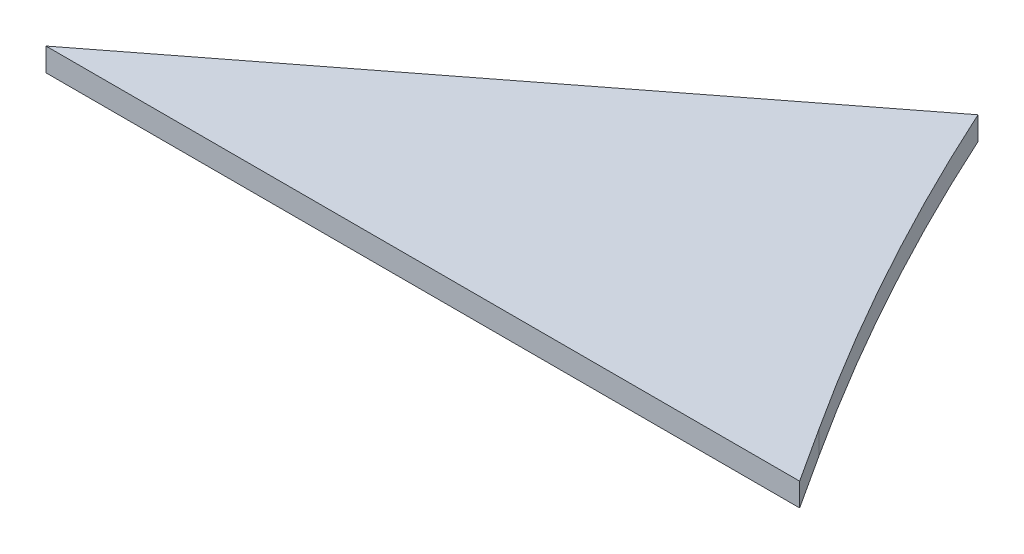
ISO-10303-21;
HEADER;
FILE_DESCRIPTION(('STEP AP214'),'2;1');
FILE_NAME('part.step','',(''),(''),'','','');
FILE_SCHEMA(('AUTOMOTIVE_DESIGN { 1 0 10303 214 1 1 1 1 }'));
ENDSEC;
DATA;
#1=APPLICATION_CONTEXT('core data for automotive mechanical design processes');
#2=APPLICATION_PROTOCOL_DEFINITION('international standard','automotive_design',2000,#1);
#3=PRODUCT_CONTEXT('',#1,'mechanical');
#4=PRODUCT('Part','Part','',(#3));
#5=PRODUCT_RELATED_PRODUCT_CATEGORY('part','',(#4));
#6=PRODUCT_DEFINITION_FORMATION('','',#4);
#7=PRODUCT_DEFINITION_CONTEXT('part definition',#1,'design');
#8=PRODUCT_DEFINITION('design','',#6,#7);
#9=PRODUCT_DEFINITION_SHAPE('','',#8);
#10=(LENGTH_UNIT() NAMED_UNIT(*) SI_UNIT(.MILLI.,.METRE.));
#11=(NAMED_UNIT(*) PLANE_ANGLE_UNIT() SI_UNIT($,.RADIAN.));
#12=(NAMED_UNIT(*) SI_UNIT($,.STERADIAN.) SOLID_ANGLE_UNIT());
#13=UNCERTAINTY_MEASURE_WITH_UNIT(LENGTH_MEASURE(1.E-05),#10,'distance_accuracy_value','');
#14=(GEOMETRIC_REPRESENTATION_CONTEXT(3) GLOBAL_UNCERTAINTY_ASSIGNED_CONTEXT((#13)) GLOBAL_UNIT_ASSIGNED_CONTEXT((#10,
#11,#12)) REPRESENTATION_CONTEXT('',''));
#15=CARTESIAN_POINT('',(0.,0.,0.));
#16=DIRECTION('',(0.,0.,1.));
#17=DIRECTION('',(1.,0.,0.));
#18=AXIS2_PLACEMENT_3D('',#15,#16,#17);
#19=CARTESIAN_POINT('',(272.730539447408,-2.54,-124.420036846506));
#20=DIRECTION('',(0.,1.,0.));
#21=DIRECTION('',(0.,0.,1.));
#22=AXIS2_PLACEMENT_3D('',#19,#20,#21);
#23=CYLINDRICAL_SURFACE('',#22,299.7704);
#24=CARTESIAN_POINT('',(272.730539447408,0.,-124.420036846506));
#25=DIRECTION('',(0.,-1.,0.));
#26=DIRECTION('',(0.,0.,-1.));
#27=AXIS2_PLACEMENT_3D('',#24,#25,#26);
#28=CIRCLE('',#27,299.7704);
#29=CARTESIAN_POINT('',(21.037356807982,0.,38.4075852849884));
#30=VERTEX_POINT('',#29);
#31=CARTESIAN_POINT('',(0.,0.,0.));
#32=VERTEX_POINT('',#31);
#33=EDGE_CURVE('E101',#30,#32,#28,.T.);
#34=ORIENTED_EDGE('',*,*,#33,.F.);
#35=DIRECTION('',(0.,1.,0.));
#36=VECTOR('',#35,1.);
#37=CARTESIAN_POINT('',(21.037356807982,-2.54,38.4075852849884));
#38=LINE('',#37,#36);
#39=CARTESIAN_POINT('',(21.037356807982,-2.54,38.4075852849884));
#40=VERTEX_POINT('',#39);
#41=EDGE_CURVE('E11',#40,#30,#38,.T.);
#42=ORIENTED_EDGE('',*,*,#41,.F.);
#43=CARTESIAN_POINT('',(272.730539447408,-2.54,-124.420036846506));
#44=DIRECTION('',(0.,-1.,0.));
#45=DIRECTION('',(0.,0.,-1.));
#46=AXIS2_PLACEMENT_3D('',#43,#44,#45);
#47=CIRCLE('',#46,299.7704);
#48=CARTESIAN_POINT('',(0.,-2.54,0.));
#49=VERTEX_POINT('',#48);
#50=EDGE_CURVE('E95',#40,#49,#47,.T.);
#51=ORIENTED_EDGE('',*,*,#50,.T.);
#52=DIRECTION('',(0.,1.,0.));
#53=VECTOR('',#52,1.);
#54=CARTESIAN_POINT('',(0.,-2.54,0.));
#55=LINE('',#54,#53);
#56=EDGE_CURVE('E40',#49,#32,#55,.T.);
#57=ORIENTED_EDGE('',*,*,#56,.T.);
#58=EDGE_LOOP('',(#34,#42,#51,#57));
#59=FACE_BOUND('',#58,.T.);
#60=ADVANCED_FACE('F37',(#59),#23,.F.);
#61=CARTESIAN_POINT('',(24.9463701934864,-2.54,44.45));
#62=DIRECTION('',(0.8396198645344,0.,-0.543174449950691));
#63=DIRECTION('',(-0.543174449950691,0.,-0.8396198645344));
#64=AXIS2_PLACEMENT_3D('',#61,#62,#63);
#65=PLANE('',#64);
#66=DIRECTION('',(-0.543174449950691,0.,-0.8396198645344));
#67=VECTOR('',#66,1.);
#68=CARTESIAN_POINT('',(24.9463701934864,0.,44.45));
#69=LINE('',#68,#67);
#70=CARTESIAN_POINT('',(24.9463701934864,0.,44.45));
#71=VERTEX_POINT('',#70);
#72=EDGE_CURVE('E97',#71,#30,#69,.T.);
#73=ORIENTED_EDGE('',*,*,#72,.F.);
#74=DIRECTION('',(0.,1.,0.));
#75=VECTOR('',#74,1.);
#76=CARTESIAN_POINT('',(24.9463701934864,-2.54,44.45));
#77=LINE('',#76,#75);
#78=CARTESIAN_POINT('',(24.9463701934864,-2.54,44.45));
#79=VERTEX_POINT('',#78);
#80=EDGE_CURVE('E46',#79,#71,#77,.T.);
#81=ORIENTED_EDGE('',*,*,#80,.F.);
#82=DIRECTION('',(-0.543174449950691,0.,-0.8396198645344));
#83=VECTOR('',#82,1.);
#84=CARTESIAN_POINT('',(24.9463701934864,-2.54,44.45));
#85=LINE('',#84,#83);
#86=EDGE_CURVE('E92',#79,#40,#85,.T.);
#87=ORIENTED_EDGE('',*,*,#86,.T.);
#88=ORIENTED_EDGE('',*,*,#41,.T.);
#89=EDGE_LOOP('',(#73,#81,#87,#88));
#90=FACE_BOUND('',#89,.T.);
#91=ADVANCED_FACE('F111',(#90),#65,.T.);
#92=CARTESIAN_POINT('',(-57.470107897294,-2.54,44.45));
#93=DIRECTION('',(0.,0.,1.));
#94=DIRECTION('',(1.,0.,0.));
#95=AXIS2_PLACEMENT_3D('',#92,#93,#94);
#96=PLANE('',#95);
#97=DIRECTION('',(1.,0.,0.));
#98=VECTOR('',#97,1.);
#99=CARTESIAN_POINT('',(-57.470107897294,0.,44.45));
#100=LINE('',#99,#98);
#101=CARTESIAN_POINT('',(-57.470107897294,0.,44.45));
#102=VERTEX_POINT('',#101);
#103=EDGE_CURVE('E87',#102,#71,#100,.T.);
#104=ORIENTED_EDGE('',*,*,#103,.F.);
#105=DIRECTION('',(0.,1.,0.));
#106=VECTOR('',#105,1.);
#107=CARTESIAN_POINT('',(-57.470107897294,-2.54,44.45));
#108=LINE('',#107,#106);
#109=CARTESIAN_POINT('',(-57.470107897294,-2.54,44.45));
#110=VERTEX_POINT('',#109);
#111=EDGE_CURVE('E82',#110,#102,#108,.T.);
#112=ORIENTED_EDGE('',*,*,#111,.F.);
#113=DIRECTION('',(1.,0.,0.));
#114=VECTOR('',#113,1.);
#115=CARTESIAN_POINT('',(-57.470107897294,-2.54,44.45));
#116=LINE('',#115,#114);
#117=EDGE_CURVE('E85',#110,#79,#116,.T.);
#118=ORIENTED_EDGE('',*,*,#117,.T.);
#119=ORIENTED_EDGE('',*,*,#80,.T.);
#120=EDGE_LOOP('',(#104,#112,#118,#119));
#121=FACE_BOUND('',#120,.T.);
#122=ADVANCED_FACE('F84',(#121),#96,.T.);
#123=CARTESIAN_POINT('',(0.,-2.54,0.));
#124=DIRECTION('',(-0.611803192039252,0.,-0.79101002156141));
#125=DIRECTION('',(-0.79101002156141,0.,0.611803192039252));
#126=AXIS2_PLACEMENT_3D('',#123,#124,#125);
#127=PLANE('',#126);
#128=DIRECTION('',(-0.79101002156141,0.,0.611803192039251));
#129=VECTOR('',#128,1.);
#130=CARTESIAN_POINT('',(0.,0.,0.));
#131=LINE('',#130,#129);
#132=EDGE_CURVE('E104',#32,#102,#131,.T.);
#133=ORIENTED_EDGE('',*,*,#132,.F.);
#134=ORIENTED_EDGE('',*,*,#56,.F.);
#135=DIRECTION('',(-0.79101002156141,0.,0.611803192039251));
#136=VECTOR('',#135,1.);
#137=CARTESIAN_POINT('',(0.,-2.54,0.));
#138=LINE('',#137,#136);
#139=EDGE_CURVE('E91',#49,#110,#138,.T.);
#140=ORIENTED_EDGE('',*,*,#139,.T.);
#141=ORIENTED_EDGE('',*,*,#111,.T.);
#142=EDGE_LOOP('',(#133,#134,#140,#141));
#143=FACE_BOUND('',#142,.T.);
#144=ADVANCED_FACE('F94',(#143),#127,.T.);
#145=CARTESIAN_POINT('',(272.730539447408,-2.54,-124.420036846506));
#146=DIRECTION('',(0.,-1.,0.));
#147=DIRECTION('',(0.,0.,-1.));
#148=AXIS2_PLACEMENT_3D('',#145,#146,#147);
#149=PLANE('',#148);
#150=ORIENTED_EDGE('',*,*,#50,.F.);
#151=ORIENTED_EDGE('',*,*,#86,.F.);
#152=ORIENTED_EDGE('',*,*,#117,.F.);
#153=ORIENTED_EDGE('',*,*,#139,.F.);
#154=EDGE_LOOP('',(#150,#151,#152,#153));
#155=FACE_BOUND('',#154,.T.);
#156=ADVANCED_FACE('F90',(#155),#149,.T.);
#157=CARTESIAN_POINT('',(272.730539447408,0.,-124.420036846506));
#158=DIRECTION('',(0.,-1.,0.));
#159=DIRECTION('',(0.,0.,-1.));
#160=AXIS2_PLACEMENT_3D('',#157,#158,#159);
#161=PLANE('',#160);
#162=ORIENTED_EDGE('',*,*,#33,.T.);
#163=ORIENTED_EDGE('',*,*,#132,.T.);
#164=ORIENTED_EDGE('',*,*,#103,.T.);
#165=ORIENTED_EDGE('',*,*,#72,.T.);
#166=EDGE_LOOP('',(#162,#163,#164,#165));
#167=FACE_BOUND('',#166,.T.);
#168=ADVANCED_FACE('F110',(#167),#161,.F.);
#169=CLOSED_SHELL('',(#60,#91,#122,#144,#156,#168));
#170=MANIFOLD_SOLID_BREP('B2',#169);
#171=ADVANCED_BREP_SHAPE_REPRESENTATION('',(#18,#170),#14);
#172=SHAPE_DEFINITION_REPRESENTATION(#9,#171);
ENDSEC;
END-ISO-10303-21;
